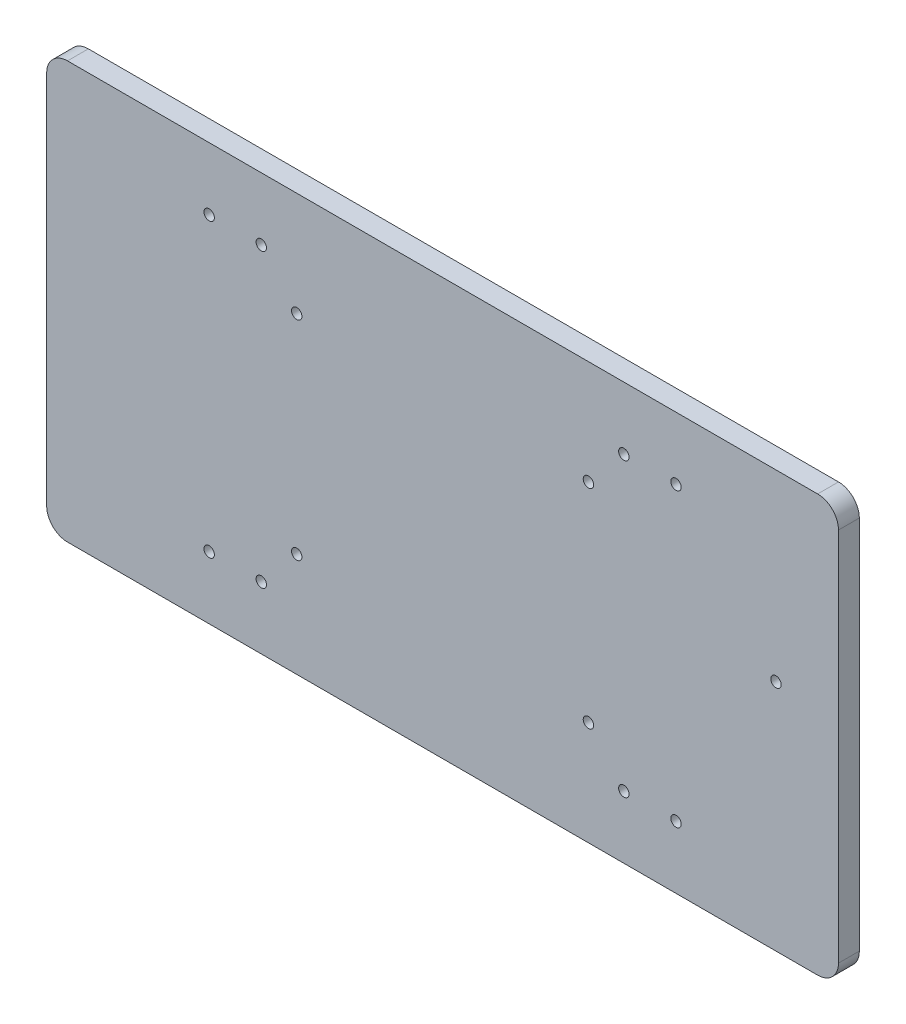
ISO-10303-21;
HEADER;
FILE_DESCRIPTION(('STEP AP214'),'2;1');
FILE_NAME('part.step','',(''),(''),'','','');
FILE_SCHEMA(('AUTOMOTIVE_DESIGN { 1 0 10303 214 1 1 1 1 }'));
ENDSEC;
DATA;
#1=APPLICATION_CONTEXT('core data for automotive mechanical design processes');
#2=APPLICATION_PROTOCOL_DEFINITION('international standard','automotive_design',2000,#1);
#3=PRODUCT_CONTEXT('',#1,'mechanical');
#4=PRODUCT('Part','Part','',(#3));
#5=PRODUCT_RELATED_PRODUCT_CATEGORY('part','',(#4));
#6=PRODUCT_DEFINITION_FORMATION('','',#4);
#7=PRODUCT_DEFINITION_CONTEXT('part definition',#1,'design');
#8=PRODUCT_DEFINITION('design','',#6,#7);
#9=PRODUCT_DEFINITION_SHAPE('','',#8);
#10=(LENGTH_UNIT() NAMED_UNIT(*) SI_UNIT(.MILLI.,.METRE.));
#11=(NAMED_UNIT(*) PLANE_ANGLE_UNIT() SI_UNIT($,.RADIAN.));
#12=(NAMED_UNIT(*) SI_UNIT($,.STERADIAN.) SOLID_ANGLE_UNIT());
#13=UNCERTAINTY_MEASURE_WITH_UNIT(LENGTH_MEASURE(1.E-05),#10,'distance_accuracy_value','');
#14=(GEOMETRIC_REPRESENTATION_CONTEXT(3) GLOBAL_UNCERTAINTY_ASSIGNED_CONTEXT((#13)) GLOBAL_UNIT_ASSIGNED_CONTEXT((#10,
#11,#12)) REPRESENTATION_CONTEXT('',''));
#15=CARTESIAN_POINT('',(0.,0.,0.));
#16=DIRECTION('',(0.,0.,1.));
#17=DIRECTION('',(1.,0.,0.));
#18=AXIS2_PLACEMENT_3D('',#15,#16,#17);
#19=CARTESIAN_POINT('',(0.,50.,5.));
#20=DIRECTION('',(0.,1.,0.));
#21=DIRECTION('',(-1.,0.,0.));
#22=AXIS2_PLACEMENT_3D('',#19,#20,#21);
#23=PLANE('',#22);
#24=DIRECTION('',(1.,0.,0.));
#25=VECTOR('',#24,1.);
#26=CARTESIAN_POINT('',(0.,50.,5.));
#27=LINE('',#26,#25);
#28=CARTESIAN_POINT('',(-90.,50.,5.));
#29=VERTEX_POINT('',#28);
#30=CARTESIAN_POINT('',(90.,50.,5.));
#31=VERTEX_POINT('',#30);
#32=EDGE_CURVE('E180',#29,#31,#27,.T.);
#33=ORIENTED_EDGE('',*,*,#32,.T.);
#34=DIRECTION('',(0.,0.,-1.));
#35=VECTOR('',#34,1.);
#36=CARTESIAN_POINT('',(90.,50.,5.));
#37=LINE('',#36,#35);
#38=CARTESIAN_POINT('',(90.,50.,0.));
#39=VERTEX_POINT('',#38);
#40=EDGE_CURVE('E11',#31,#39,#37,.T.);
#41=ORIENTED_EDGE('',*,*,#40,.T.);
#42=DIRECTION('',(1.,0.,0.));
#43=VECTOR('',#42,1.);
#44=CARTESIAN_POINT('',(0.,50.,0.));
#45=LINE('',#44,#43);
#46=CARTESIAN_POINT('',(-90.,50.,0.));
#47=VERTEX_POINT('',#46);
#48=EDGE_CURVE('E183',#47,#39,#45,.T.);
#49=ORIENTED_EDGE('',*,*,#48,.F.);
#50=DIRECTION('',(0.,0.,-1.));
#51=VECTOR('',#50,1.);
#52=CARTESIAN_POINT('',(-90.,50.,5.));
#53=LINE('',#52,#51);
#54=EDGE_CURVE('E48',#47,#29,#53,.F.);
#55=ORIENTED_EDGE('',*,*,#54,.T.);
#56=EDGE_LOOP('',(#33,#41,#49,#55));
#57=FACE_BOUND('',#56,.T.);
#58=ADVANCED_FACE('F39',(#57),#23,.T.);
#59=CARTESIAN_POINT('',(-95.,0.,5.));
#60=DIRECTION('',(1.,0.,0.));
#61=DIRECTION('',(0.,1.,0.));
#62=AXIS2_PLACEMENT_3D('',#59,#60,#61);
#63=PLANE('',#62);
#64=DIRECTION('',(0.,-1.,0.));
#65=VECTOR('',#64,1.);
#66=CARTESIAN_POINT('',(-95.,0.,0.));
#67=LINE('',#66,#65);
#68=CARTESIAN_POINT('',(-95.,45.,0.));
#69=VERTEX_POINT('',#68);
#70=CARTESIAN_POINT('',(-95.,-45.,0.));
#71=VERTEX_POINT('',#70);
#72=EDGE_CURVE('E129',#69,#71,#67,.T.);
#73=ORIENTED_EDGE('',*,*,#72,.T.);
#74=DIRECTION('',(0.,0.,-1.));
#75=VECTOR('',#74,1.);
#76=CARTESIAN_POINT('',(-95.,-45.,5.));
#77=LINE('',#76,#75);
#78=CARTESIAN_POINT('',(-95.,-45.,5.));
#79=VERTEX_POINT('',#78);
#80=EDGE_CURVE('E156',#71,#79,#77,.F.);
#81=ORIENTED_EDGE('',*,*,#80,.T.);
#82=DIRECTION('',(0.,-1.,0.));
#83=VECTOR('',#82,1.);
#84=CARTESIAN_POINT('',(-95.,0.,5.));
#85=LINE('',#84,#83);
#86=CARTESIAN_POINT('',(-95.,45.,5.));
#87=VERTEX_POINT('',#86);
#88=EDGE_CURVE('E192',#87,#79,#85,.T.);
#89=ORIENTED_EDGE('',*,*,#88,.F.);
#90=DIRECTION('',(0.,0.,-1.));
#91=VECTOR('',#90,1.);
#92=CARTESIAN_POINT('',(-95.,45.,0.));
#93=LINE('',#92,#91);
#94=EDGE_CURVE('E152',#87,#69,#93,.T.);
#95=ORIENTED_EDGE('',*,*,#94,.T.);
#96=EDGE_LOOP('',(#73,#81,#89,#95));
#97=FACE_BOUND('',#96,.T.);
#98=ADVANCED_FACE('F199',(#97),#63,.F.);
#99=CARTESIAN_POINT('',(0.,-50.,5.));
#100=DIRECTION('',(0.,-1.,0.));
#101=DIRECTION('',(1.,0.,0.));
#102=AXIS2_PLACEMENT_3D('',#99,#100,#101);
#103=PLANE('',#102);
#104=DIRECTION('',(-1.,0.,0.));
#105=VECTOR('',#104,1.);
#106=CARTESIAN_POINT('',(0.,-50.,5.));
#107=LINE('',#106,#105);
#108=CARTESIAN_POINT('',(90.,-50.,5.));
#109=VERTEX_POINT('',#108);
#110=CARTESIAN_POINT('',(-90.,-50.,5.));
#111=VERTEX_POINT('',#110);
#112=EDGE_CURVE('E266',#109,#111,#107,.T.);
#113=ORIENTED_EDGE('',*,*,#112,.T.);
#114=DIRECTION('',(0.,0.,-1.));
#115=VECTOR('',#114,1.);
#116=CARTESIAN_POINT('',(-90.,-50.,0.));
#117=LINE('',#116,#115);
#118=CARTESIAN_POINT('',(-90.,-50.,0.));
#119=VERTEX_POINT('',#118);
#120=EDGE_CURVE('E127',#111,#119,#117,.T.);
#121=ORIENTED_EDGE('',*,*,#120,.T.);
#122=DIRECTION('',(-1.,0.,0.));
#123=VECTOR('',#122,1.);
#124=CARTESIAN_POINT('',(0.,-50.,0.));
#125=LINE('',#124,#123);
#126=CARTESIAN_POINT('',(90.,-50.,0.));
#127=VERTEX_POINT('',#126);
#128=EDGE_CURVE('E111',#127,#119,#125,.T.);
#129=ORIENTED_EDGE('',*,*,#128,.F.);
#130=DIRECTION('',(0.,0.,-1.));
#131=VECTOR('',#130,1.);
#132=CARTESIAN_POINT('',(90.,-50.,5.));
#133=LINE('',#132,#131);
#134=EDGE_CURVE('E125',#127,#109,#133,.F.);
#135=ORIENTED_EDGE('',*,*,#134,.T.);
#136=EDGE_LOOP('',(#113,#121,#129,#135));
#137=FACE_BOUND('',#136,.T.);
#138=ADVANCED_FACE('F124',(#137),#103,.T.);
#139=CARTESIAN_POINT('',(-43.5,35.,5.));
#140=DIRECTION('',(0.,0.,-1.));
#141=DIRECTION('',(-1.,0.,0.));
#142=AXIS2_PLACEMENT_3D('',#139,#140,#141);
#143=CYLINDRICAL_SURFACE('',#142,1.25);
#144=CARTESIAN_POINT('',(-43.5,35.,5.));
#145=DIRECTION('',(0.,0.,1.));
#146=DIRECTION('',(1.,0.,0.));
#147=AXIS2_PLACEMENT_3D('',#144,#145,#146);
#148=CIRCLE('',#147,1.25);
#149=CARTESIAN_POINT('',(-42.25,35.,5.));
#150=VERTEX_POINT('',#149);
#151=EDGE_CURVE('E140',#150,#150,#148,.F.);
#152=ORIENTED_EDGE('',*,*,#151,.F.);
#153=EDGE_LOOP('',(#152));
#154=FACE_BOUND('',#153,.T.);
#155=CARTESIAN_POINT('',(-43.5,35.,0.));
#156=DIRECTION('',(0.,0.,1.));
#157=DIRECTION('',(1.,0.,0.));
#158=AXIS2_PLACEMENT_3D('',#155,#156,#157);
#159=CIRCLE('',#158,1.25);
#160=CARTESIAN_POINT('',(-42.25,35.,0.));
#161=VERTEX_POINT('',#160);
#162=EDGE_CURVE('E209',#161,#161,#159,.F.);
#163=ORIENTED_EDGE('',*,*,#162,.T.);
#164=EDGE_LOOP('',(#163));
#165=FACE_BOUND('',#164,.T.);
#166=ADVANCED_FACE('F332',(#154,#165),#143,.F.);
#167=CARTESIAN_POINT('',(95.,0.,5.));
#168=DIRECTION('',(1.,0.,0.));
#169=DIRECTION('',(0.,1.,0.));
#170=AXIS2_PLACEMENT_3D('',#167,#168,#169);
#171=PLANE('',#170);
#172=DIRECTION('',(0.,-1.,0.));
#173=VECTOR('',#172,1.);
#174=CARTESIAN_POINT('',(95.,0.,5.));
#175=LINE('',#174,#173);
#176=CARTESIAN_POINT('',(95.,45.,5.));
#177=VERTEX_POINT('',#176);
#178=CARTESIAN_POINT('',(95.,-45.,5.));
#179=VERTEX_POINT('',#178);
#180=EDGE_CURVE('E269',#177,#179,#175,.T.);
#181=ORIENTED_EDGE('',*,*,#180,.T.);
#182=DIRECTION('',(0.,0.,-1.));
#183=VECTOR('',#182,1.);
#184=CARTESIAN_POINT('',(95.,-45.,5.));
#185=LINE('',#184,#183);
#186=CARTESIAN_POINT('',(95.,-45.,0.));
#187=VERTEX_POINT('',#186);
#188=EDGE_CURVE('E172',#179,#187,#185,.T.);
#189=ORIENTED_EDGE('',*,*,#188,.T.);
#190=DIRECTION('',(0.,-1.,0.));
#191=VECTOR('',#190,1.);
#192=CARTESIAN_POINT('',(95.,0.,0.));
#193=LINE('',#192,#191);
#194=CARTESIAN_POINT('',(95.,45.,0.));
#195=VERTEX_POINT('',#194);
#196=EDGE_CURVE('E112',#195,#187,#193,.T.);
#197=ORIENTED_EDGE('',*,*,#196,.F.);
#198=DIRECTION('',(0.,0.,-1.));
#199=VECTOR('',#198,1.);
#200=CARTESIAN_POINT('',(95.,45.,5.));
#201=LINE('',#200,#199);
#202=EDGE_CURVE('E62',#195,#177,#201,.F.);
#203=ORIENTED_EDGE('',*,*,#202,.T.);
#204=EDGE_LOOP('',(#181,#189,#197,#203));
#205=FACE_BOUND('',#204,.T.);
#206=ADVANCED_FACE('F322',(#205),#171,.T.);
#207=CARTESIAN_POINT('',(35.,25.,5.));
#208=DIRECTION('',(0.,0.,-1.));
#209=DIRECTION('',(-1.,0.,0.));
#210=AXIS2_PLACEMENT_3D('',#207,#208,#209);
#211=CYLINDRICAL_SURFACE('',#210,1.25);
#212=CARTESIAN_POINT('',(35.,25.,5.));
#213=DIRECTION('',(0.,0.,1.));
#214=DIRECTION('',(1.,0.,0.));
#215=AXIS2_PLACEMENT_3D('',#212,#213,#214);
#216=CIRCLE('',#215,1.25);
#217=CARTESIAN_POINT('',(36.25,25.,5.));
#218=VERTEX_POINT('',#217);
#219=EDGE_CURVE('E193',#218,#218,#216,.T.);
#220=ORIENTED_EDGE('',*,*,#219,.T.);
#221=EDGE_LOOP('',(#220));
#222=FACE_BOUND('',#221,.T.);
#223=CARTESIAN_POINT('',(35.,25.,0.));
#224=DIRECTION('',(0.,0.,1.));
#225=DIRECTION('',(1.,0.,0.));
#226=AXIS2_PLACEMENT_3D('',#223,#224,#225);
#227=CIRCLE('',#226,1.25);
#228=CARTESIAN_POINT('',(36.25,25.,0.));
#229=VERTEX_POINT('',#228);
#230=EDGE_CURVE('E204',#229,#229,#227,.T.);
#231=ORIENTED_EDGE('',*,*,#230,.F.);
#232=EDGE_LOOP('',(#231));
#233=FACE_BOUND('',#232,.T.);
#234=ADVANCED_FACE('F319',(#222,#233),#211,.F.);
#235=CARTESIAN_POINT('',(80.,5.96994535519127,5.));
#236=DIRECTION('',(0.,0.,-1.));
#237=DIRECTION('',(-1.,0.,0.));
#238=AXIS2_PLACEMENT_3D('',#235,#236,#237);
#239=CYLINDRICAL_SURFACE('',#238,1.25);
#240=CARTESIAN_POINT('',(80.,5.96994535519127,5.));
#241=DIRECTION('',(0.,0.,1.));
#242=DIRECTION('',(1.,0.,0.));
#243=AXIS2_PLACEMENT_3D('',#240,#241,#242);
#244=CIRCLE('',#243,1.25);
#245=CARTESIAN_POINT('',(81.25,5.96994535519127,5.));
#246=VERTEX_POINT('',#245);
#247=EDGE_CURVE('E257',#246,#246,#244,.T.);
#248=ORIENTED_EDGE('',*,*,#247,.T.);
#249=EDGE_LOOP('',(#248));
#250=FACE_BOUND('',#249,.T.);
#251=CARTESIAN_POINT('',(80.,5.96994535519127,0.));
#252=DIRECTION('',(0.,0.,1.));
#253=DIRECTION('',(1.,0.,0.));
#254=AXIS2_PLACEMENT_3D('',#251,#252,#253);
#255=CIRCLE('',#254,1.25);
#256=CARTESIAN_POINT('',(81.25,5.96994535519127,0.));
#257=VERTEX_POINT('',#256);
#258=EDGE_CURVE('E311',#257,#257,#255,.T.);
#259=ORIENTED_EDGE('',*,*,#258,.F.);
#260=EDGE_LOOP('',(#259));
#261=FACE_BOUND('',#260,.T.);
#262=ADVANCED_FACE('F321',(#250,#261),#239,.F.);
#263=CARTESIAN_POINT('',(-43.5,-35.,5.));
#264=DIRECTION('',(0.,0.,-1.));
#265=DIRECTION('',(-1.,0.,0.));
#266=AXIS2_PLACEMENT_3D('',#263,#264,#265);
#267=CYLINDRICAL_SURFACE('',#266,1.25);
#268=CARTESIAN_POINT('',(-43.5,-35.,5.));
#269=DIRECTION('',(0.,0.,1.));
#270=DIRECTION('',(1.,0.,0.));
#271=AXIS2_PLACEMENT_3D('',#268,#269,#270);
#272=CIRCLE('',#271,1.25);
#273=CARTESIAN_POINT('',(-42.25,-35.,5.));
#274=VERTEX_POINT('',#273);
#275=EDGE_CURVE('E253',#274,#274,#272,.T.);
#276=ORIENTED_EDGE('',*,*,#275,.T.);
#277=EDGE_LOOP('',(#276));
#278=FACE_BOUND('',#277,.T.);
#279=CARTESIAN_POINT('',(-43.5,-35.,0.));
#280=DIRECTION('',(0.,0.,1.));
#281=DIRECTION('',(1.,0.,0.));
#282=AXIS2_PLACEMENT_3D('',#279,#280,#281);
#283=CIRCLE('',#282,1.25);
#284=CARTESIAN_POINT('',(-42.25,-35.,0.));
#285=VERTEX_POINT('',#284);
#286=EDGE_CURVE('E307',#285,#285,#283,.T.);
#287=ORIENTED_EDGE('',*,*,#286,.F.);
#288=EDGE_LOOP('',(#287));
#289=FACE_BOUND('',#288,.T.);
#290=ADVANCED_FACE('F329',(#278,#289),#267,.F.);
#291=CARTESIAN_POINT('',(-56.0092746529231,-35.,5.));
#292=DIRECTION('',(0.,0.,-1.));
#293=DIRECTION('',(-1.,0.,0.));
#294=AXIS2_PLACEMENT_3D('',#291,#292,#293);
#295=CYLINDRICAL_SURFACE('',#294,1.25);
#296=CARTESIAN_POINT('',(-56.0092746529231,-35.,5.));
#297=DIRECTION('',(0.,0.,1.));
#298=DIRECTION('',(1.,0.,0.));
#299=AXIS2_PLACEMENT_3D('',#296,#297,#298);
#300=CIRCLE('',#299,1.25);
#301=CARTESIAN_POINT('',(-54.7592746529231,-35.,5.));
#302=VERTEX_POINT('',#301);
#303=EDGE_CURVE('E249',#302,#302,#300,.T.);
#304=ORIENTED_EDGE('',*,*,#303,.T.);
#305=EDGE_LOOP('',(#304));
#306=FACE_BOUND('',#305,.T.);
#307=CARTESIAN_POINT('',(-56.0092746529231,-35.,0.));
#308=DIRECTION('',(0.,0.,1.));
#309=DIRECTION('',(1.,0.,0.));
#310=AXIS2_PLACEMENT_3D('',#307,#308,#309);
#311=CIRCLE('',#310,1.25);
#312=CARTESIAN_POINT('',(-54.7592746529231,-35.,0.));
#313=VERTEX_POINT('',#312);
#314=EDGE_CURVE('E303',#313,#313,#311,.T.);
#315=ORIENTED_EDGE('',*,*,#314,.F.);
#316=EDGE_LOOP('',(#315));
#317=FACE_BOUND('',#316,.T.);
#318=ADVANCED_FACE('F385',(#306,#317),#295,.F.);
#319=CARTESIAN_POINT('',(-56.0092746529231,35.,5.));
#320=DIRECTION('',(0.,0.,-1.));
#321=DIRECTION('',(-1.,0.,0.));
#322=AXIS2_PLACEMENT_3D('',#319,#320,#321);
#323=CYLINDRICAL_SURFACE('',#322,1.25);
#324=CARTESIAN_POINT('',(-56.0092746529231,35.,5.));
#325=DIRECTION('',(0.,0.,1.));
#326=DIRECTION('',(1.,0.,0.));
#327=AXIS2_PLACEMENT_3D('',#324,#325,#326);
#328=CIRCLE('',#327,1.25);
#329=CARTESIAN_POINT('',(-54.7592746529231,35.,5.));
#330=VERTEX_POINT('',#329);
#331=EDGE_CURVE('E245',#330,#330,#328,.F.);
#332=ORIENTED_EDGE('',*,*,#331,.F.);
#333=EDGE_LOOP('',(#332));
#334=FACE_BOUND('',#333,.T.);
#335=CARTESIAN_POINT('',(-56.0092746529231,35.,0.));
#336=DIRECTION('',(0.,0.,1.));
#337=DIRECTION('',(1.,0.,0.));
#338=AXIS2_PLACEMENT_3D('',#335,#336,#337);
#339=CIRCLE('',#338,1.25);
#340=CARTESIAN_POINT('',(-54.7592746529231,35.,0.));
#341=VERTEX_POINT('',#340);
#342=EDGE_CURVE('E299',#341,#341,#339,.F.);
#343=ORIENTED_EDGE('',*,*,#342,.T.);
#344=EDGE_LOOP('',(#343));
#345=FACE_BOUND('',#344,.T.);
#346=ADVANCED_FACE('F392',(#334,#345),#323,.F.);
#347=CARTESIAN_POINT('',(43.5,-35.,5.));
#348=DIRECTION('',(0.,0.,-1.));
#349=DIRECTION('',(-1.,0.,0.));
#350=AXIS2_PLACEMENT_3D('',#347,#348,#349);
#351=CYLINDRICAL_SURFACE('',#350,1.25);
#352=CARTESIAN_POINT('',(43.5,-35.,5.));
#353=DIRECTION('',(0.,0.,1.));
#354=DIRECTION('',(1.,0.,0.));
#355=AXIS2_PLACEMENT_3D('',#352,#353,#354);
#356=CIRCLE('',#355,1.25);
#357=CARTESIAN_POINT('',(44.75,-35.,5.));
#358=VERTEX_POINT('',#357);
#359=EDGE_CURVE('E241',#358,#358,#356,.F.);
#360=ORIENTED_EDGE('',*,*,#359,.F.);
#361=EDGE_LOOP('',(#360));
#362=FACE_BOUND('',#361,.T.);
#363=CARTESIAN_POINT('',(43.5,-35.,0.));
#364=DIRECTION('',(0.,0.,1.));
#365=DIRECTION('',(1.,0.,0.));
#366=AXIS2_PLACEMENT_3D('',#363,#364,#365);
#367=CIRCLE('',#366,1.25);
#368=CARTESIAN_POINT('',(44.75,-35.,0.));
#369=VERTEX_POINT('',#368);
#370=EDGE_CURVE('E295',#369,#369,#367,.F.);
#371=ORIENTED_EDGE('',*,*,#370,.T.);
#372=EDGE_LOOP('',(#371));
#373=FACE_BOUND('',#372,.T.);
#374=ADVANCED_FACE('F398',(#362,#373),#351,.F.);
#375=CARTESIAN_POINT('',(43.5,35.,5.));
#376=DIRECTION('',(0.,0.,-1.));
#377=DIRECTION('',(-1.,0.,0.));
#378=AXIS2_PLACEMENT_3D('',#375,#376,#377);
#379=CYLINDRICAL_SURFACE('',#378,1.25);
#380=CARTESIAN_POINT('',(43.5,35.,5.));
#381=DIRECTION('',(0.,0.,1.));
#382=DIRECTION('',(1.,0.,0.));
#383=AXIS2_PLACEMENT_3D('',#380,#381,#382);
#384=CIRCLE('',#383,1.25);
#385=CARTESIAN_POINT('',(44.75,35.,5.));
#386=VERTEX_POINT('',#385);
#387=EDGE_CURVE('E237',#386,#386,#384,.T.);
#388=ORIENTED_EDGE('',*,*,#387,.T.);
#389=EDGE_LOOP('',(#388));
#390=FACE_BOUND('',#389,.T.);
#391=CARTESIAN_POINT('',(43.5,35.,0.));
#392=DIRECTION('',(0.,0.,1.));
#393=DIRECTION('',(1.,0.,0.));
#394=AXIS2_PLACEMENT_3D('',#391,#392,#393);
#395=CIRCLE('',#394,1.25);
#396=CARTESIAN_POINT('',(44.75,35.,0.));
#397=VERTEX_POINT('',#396);
#398=EDGE_CURVE('E291',#397,#397,#395,.T.);
#399=ORIENTED_EDGE('',*,*,#398,.F.);
#400=EDGE_LOOP('',(#399));
#401=FACE_BOUND('',#400,.T.);
#402=ADVANCED_FACE('F402',(#390,#401),#379,.F.);
#403=CARTESIAN_POINT('',(56.0092746529231,35.,5.));
#404=DIRECTION('',(0.,0.,-1.));
#405=DIRECTION('',(-1.,0.,0.));
#406=AXIS2_PLACEMENT_3D('',#403,#404,#405);
#407=CYLINDRICAL_SURFACE('',#406,1.25);
#408=CARTESIAN_POINT('',(56.0092746529231,35.,5.));
#409=DIRECTION('',(0.,0.,1.));
#410=DIRECTION('',(1.,0.,0.));
#411=AXIS2_PLACEMENT_3D('',#408,#409,#410);
#412=CIRCLE('',#411,1.25);
#413=CARTESIAN_POINT('',(57.2592746529231,35.,5.));
#414=VERTEX_POINT('',#413);
#415=EDGE_CURVE('E233',#414,#414,#412,.T.);
#416=ORIENTED_EDGE('',*,*,#415,.T.);
#417=EDGE_LOOP('',(#416));
#418=FACE_BOUND('',#417,.T.);
#419=CARTESIAN_POINT('',(56.0092746529231,35.,0.));
#420=DIRECTION('',(0.,0.,1.));
#421=DIRECTION('',(1.,0.,0.));
#422=AXIS2_PLACEMENT_3D('',#419,#420,#421);
#423=CIRCLE('',#422,1.25);
#424=CARTESIAN_POINT('',(57.2592746529231,35.,0.));
#425=VERTEX_POINT('',#424);
#426=EDGE_CURVE('E287',#425,#425,#423,.T.);
#427=ORIENTED_EDGE('',*,*,#426,.F.);
#428=EDGE_LOOP('',(#427));
#429=FACE_BOUND('',#428,.T.);
#430=ADVANCED_FACE('F406',(#418,#429),#407,.F.);
#431=CARTESIAN_POINT('',(-35.,25.,5.));
#432=DIRECTION('',(0.,0.,-1.));
#433=DIRECTION('',(-1.,0.,0.));
#434=AXIS2_PLACEMENT_3D('',#431,#432,#433);
#435=CYLINDRICAL_SURFACE('',#434,1.25);
#436=CARTESIAN_POINT('',(-35.,25.,5.));
#437=DIRECTION('',(0.,0.,1.));
#438=DIRECTION('',(1.,0.,0.));
#439=AXIS2_PLACEMENT_3D('',#436,#437,#438);
#440=CIRCLE('',#439,1.25);
#441=CARTESIAN_POINT('',(-33.75,25.,5.));
#442=VERTEX_POINT('',#441);
#443=EDGE_CURVE('E227',#442,#442,#440,.T.);
#444=ORIENTED_EDGE('',*,*,#443,.T.);
#445=EDGE_LOOP('',(#444));
#446=FACE_BOUND('',#445,.T.);
#447=CARTESIAN_POINT('',(-35.,25.,0.));
#448=DIRECTION('',(0.,0.,1.));
#449=DIRECTION('',(1.,0.,0.));
#450=AXIS2_PLACEMENT_3D('',#447,#448,#449);
#451=CIRCLE('',#450,1.25);
#452=CARTESIAN_POINT('',(-33.75,25.,0.));
#453=VERTEX_POINT('',#452);
#454=EDGE_CURVE('E283',#453,#453,#451,.T.);
#455=ORIENTED_EDGE('',*,*,#454,.F.);
#456=EDGE_LOOP('',(#455));
#457=FACE_BOUND('',#456,.T.);
#458=ADVANCED_FACE('F410',(#446,#457),#435,.F.);
#459=CARTESIAN_POINT('',(-35.,-25.,5.));
#460=DIRECTION('',(0.,0.,-1.));
#461=DIRECTION('',(-1.,0.,0.));
#462=AXIS2_PLACEMENT_3D('',#459,#460,#461);
#463=CYLINDRICAL_SURFACE('',#462,1.25);
#464=CARTESIAN_POINT('',(-35.,-25.,5.));
#465=DIRECTION('',(0.,0.,1.));
#466=DIRECTION('',(1.,0.,0.));
#467=AXIS2_PLACEMENT_3D('',#464,#465,#466);
#468=CIRCLE('',#467,1.25);
#469=CARTESIAN_POINT('',(-33.75,-25.,5.));
#470=VERTEX_POINT('',#469);
#471=EDGE_CURVE('E221',#470,#470,#468,.T.);
#472=ORIENTED_EDGE('',*,*,#471,.T.);
#473=EDGE_LOOP('',(#472));
#474=FACE_BOUND('',#473,.T.);
#475=CARTESIAN_POINT('',(-35.,-25.,0.));
#476=DIRECTION('',(0.,0.,1.));
#477=DIRECTION('',(1.,0.,0.));
#478=AXIS2_PLACEMENT_3D('',#475,#476,#477);
#479=CIRCLE('',#478,1.25);
#480=CARTESIAN_POINT('',(-33.75,-25.,0.));
#481=VERTEX_POINT('',#480);
#482=EDGE_CURVE('E279',#481,#481,#479,.T.);
#483=ORIENTED_EDGE('',*,*,#482,.F.);
#484=EDGE_LOOP('',(#483));
#485=FACE_BOUND('',#484,.T.);
#486=ADVANCED_FACE('F414',(#474,#485),#463,.F.);
#487=CARTESIAN_POINT('',(35.,-25.,5.));
#488=DIRECTION('',(0.,0.,-1.));
#489=DIRECTION('',(-1.,0.,0.));
#490=AXIS2_PLACEMENT_3D('',#487,#488,#489);
#491=CYLINDRICAL_SURFACE('',#490,1.25);
#492=CARTESIAN_POINT('',(35.,-25.,5.));
#493=DIRECTION('',(0.,0.,1.));
#494=DIRECTION('',(1.,0.,0.));
#495=AXIS2_PLACEMENT_3D('',#492,#493,#494);
#496=CIRCLE('',#495,1.25);
#497=CARTESIAN_POINT('',(36.25,-25.,5.));
#498=VERTEX_POINT('',#497);
#499=EDGE_CURVE('E216',#498,#498,#496,.T.);
#500=ORIENTED_EDGE('',*,*,#499,.T.);
#501=EDGE_LOOP('',(#500));
#502=FACE_BOUND('',#501,.T.);
#503=CARTESIAN_POINT('',(35.,-25.,0.));
#504=DIRECTION('',(0.,0.,1.));
#505=DIRECTION('',(1.,0.,0.));
#506=AXIS2_PLACEMENT_3D('',#503,#504,#505);
#507=CIRCLE('',#506,1.25);
#508=CARTESIAN_POINT('',(36.25,-25.,0.));
#509=VERTEX_POINT('',#508);
#510=EDGE_CURVE('E275',#509,#509,#507,.T.);
#511=ORIENTED_EDGE('',*,*,#510,.F.);
#512=EDGE_LOOP('',(#511));
#513=FACE_BOUND('',#512,.T.);
#514=ADVANCED_FACE('F349',(#502,#513),#491,.F.);
#515=CARTESIAN_POINT('',(56.0092746529231,-35.,5.));
#516=DIRECTION('',(0.,0.,-1.));
#517=DIRECTION('',(-1.,0.,0.));
#518=AXIS2_PLACEMENT_3D('',#515,#516,#517);
#519=CYLINDRICAL_SURFACE('',#518,1.25);
#520=CARTESIAN_POINT('',(56.0092746529231,-35.,5.));
#521=DIRECTION('',(0.,0.,1.));
#522=DIRECTION('',(1.,0.,0.));
#523=AXIS2_PLACEMENT_3D('',#520,#521,#522);
#524=CIRCLE('',#523,1.25);
#525=CARTESIAN_POINT('',(57.2592746529231,-35.,5.));
#526=VERTEX_POINT('',#525);
#527=EDGE_CURVE('E133',#526,#526,#524,.F.);
#528=ORIENTED_EDGE('',*,*,#527,.F.);
#529=EDGE_LOOP('',(#528));
#530=FACE_BOUND('',#529,.T.);
#531=CARTESIAN_POINT('',(56.0092746529231,-35.,0.));
#532=DIRECTION('',(0.,0.,1.));
#533=DIRECTION('',(1.,0.,0.));
#534=AXIS2_PLACEMENT_3D('',#531,#532,#533);
#535=CIRCLE('',#534,1.25);
#536=CARTESIAN_POINT('',(57.2592746529231,-35.,0.));
#537=VERTEX_POINT('',#536);
#538=EDGE_CURVE('E143',#537,#537,#535,.F.);
#539=ORIENTED_EDGE('',*,*,#538,.T.);
#540=EDGE_LOOP('',(#539));
#541=FACE_BOUND('',#540,.T.);
#542=ADVANCED_FACE('F346',(#530,#541),#519,.F.);
#543=CARTESIAN_POINT('',(0.,0.,5.));
#544=DIRECTION('',(0.,0.,1.));
#545=DIRECTION('',(1.,0.,0.));
#546=AXIS2_PLACEMENT_3D('',#543,#544,#545);
#547=PLANE('',#546);
#548=ORIENTED_EDGE('',*,*,#499,.F.);
#549=EDGE_LOOP('',(#548));
#550=FACE_BOUND('',#549,.T.);
#551=ORIENTED_EDGE('',*,*,#471,.F.);
#552=EDGE_LOOP('',(#551));
#553=FACE_BOUND('',#552,.T.);
#554=ORIENTED_EDGE('',*,*,#443,.F.);
#555=EDGE_LOOP('',(#554));
#556=FACE_BOUND('',#555,.T.);
#557=ORIENTED_EDGE('',*,*,#415,.F.);
#558=EDGE_LOOP('',(#557));
#559=FACE_BOUND('',#558,.T.);
#560=ORIENTED_EDGE('',*,*,#387,.F.);
#561=EDGE_LOOP('',(#560));
#562=FACE_BOUND('',#561,.T.);
#563=ORIENTED_EDGE('',*,*,#359,.T.);
#564=EDGE_LOOP('',(#563));
#565=FACE_BOUND('',#564,.T.);
#566=ORIENTED_EDGE('',*,*,#331,.T.);
#567=EDGE_LOOP('',(#566));
#568=FACE_BOUND('',#567,.T.);
#569=ORIENTED_EDGE('',*,*,#303,.F.);
#570=EDGE_LOOP('',(#569));
#571=FACE_BOUND('',#570,.T.);
#572=ORIENTED_EDGE('',*,*,#275,.F.);
#573=EDGE_LOOP('',(#572));
#574=FACE_BOUND('',#573,.T.);
#575=ORIENTED_EDGE('',*,*,#247,.F.);
#576=EDGE_LOOP('',(#575));
#577=FACE_BOUND('',#576,.T.);
#578=ORIENTED_EDGE('',*,*,#219,.F.);
#579=EDGE_LOOP('',(#578));
#580=FACE_BOUND('',#579,.T.);
#581=ORIENTED_EDGE('',*,*,#88,.T.);
#582=CARTESIAN_POINT('',(-90.,-45.,5.));
#583=DIRECTION('',(0.,0.,1.));
#584=DIRECTION('',(1.,0.,0.));
#585=AXIS2_PLACEMENT_3D('',#582,#583,#584);
#586=CIRCLE('',#585,5.);
#587=EDGE_CURVE('E167',#79,#111,#586,.T.);
#588=ORIENTED_EDGE('',*,*,#587,.T.);
#589=ORIENTED_EDGE('',*,*,#112,.F.);
#590=CARTESIAN_POINT('',(90.,-45.,5.));
#591=DIRECTION('',(0.,0.,1.));
#592=DIRECTION('',(1.,0.,0.));
#593=AXIS2_PLACEMENT_3D('',#590,#591,#592);
#594=CIRCLE('',#593,5.);
#595=EDGE_CURVE('E55',#109,#179,#594,.T.);
#596=ORIENTED_EDGE('',*,*,#595,.T.);
#597=ORIENTED_EDGE('',*,*,#180,.F.);
#598=CARTESIAN_POINT('',(90.,45.,5.));
#599=DIRECTION('',(0.,0.,1.));
#600=DIRECTION('',(1.,0.,0.));
#601=AXIS2_PLACEMENT_3D('',#598,#599,#600);
#602=CIRCLE('',#601,5.);
#603=EDGE_CURVE('E162',#177,#31,#602,.T.);
#604=ORIENTED_EDGE('',*,*,#603,.T.);
#605=ORIENTED_EDGE('',*,*,#32,.F.);
#606=CARTESIAN_POINT('',(-90.,45.,5.));
#607=DIRECTION('',(0.,0.,1.));
#608=DIRECTION('',(1.,0.,0.));
#609=AXIS2_PLACEMENT_3D('',#606,#607,#608);
#610=CIRCLE('',#609,5.);
#611=EDGE_CURVE('E159',#29,#87,#610,.T.);
#612=ORIENTED_EDGE('',*,*,#611,.T.);
#613=EDGE_LOOP('',(#581,#588,#589,#596,#597,#604,#605,#612));
#614=FACE_BOUND('',#613,.T.);
#615=ORIENTED_EDGE('',*,*,#151,.T.);
#616=EDGE_LOOP('',(#615));
#617=FACE_BOUND('',#616,.T.);
#618=ORIENTED_EDGE('',*,*,#527,.T.);
#619=EDGE_LOOP('',(#618));
#620=FACE_BOUND('',#619,.T.);
#621=ADVANCED_FACE('F187',(#550,#553,#556,#559,#562,#565,#568,#571,#574,#577,#580,#614,#617,
#620),#547,.T.);
#622=CARTESIAN_POINT('',(0.,0.,0.));
#623=DIRECTION('',(0.,0.,1.));
#624=DIRECTION('',(1.,0.,0.));
#625=AXIS2_PLACEMENT_3D('',#622,#623,#624);
#626=PLANE('',#625);
#627=ORIENTED_EDGE('',*,*,#510,.T.);
#628=EDGE_LOOP('',(#627));
#629=FACE_BOUND('',#628,.T.);
#630=ORIENTED_EDGE('',*,*,#482,.T.);
#631=EDGE_LOOP('',(#630));
#632=FACE_BOUND('',#631,.T.);
#633=ORIENTED_EDGE('',*,*,#454,.T.);
#634=EDGE_LOOP('',(#633));
#635=FACE_BOUND('',#634,.T.);
#636=ORIENTED_EDGE('',*,*,#426,.T.);
#637=EDGE_LOOP('',(#636));
#638=FACE_BOUND('',#637,.T.);
#639=ORIENTED_EDGE('',*,*,#398,.T.);
#640=EDGE_LOOP('',(#639));
#641=FACE_BOUND('',#640,.T.);
#642=ORIENTED_EDGE('',*,*,#370,.F.);
#643=EDGE_LOOP('',(#642));
#644=FACE_BOUND('',#643,.T.);
#645=ORIENTED_EDGE('',*,*,#342,.F.);
#646=EDGE_LOOP('',(#645));
#647=FACE_BOUND('',#646,.T.);
#648=ORIENTED_EDGE('',*,*,#314,.T.);
#649=EDGE_LOOP('',(#648));
#650=FACE_BOUND('',#649,.T.);
#651=ORIENTED_EDGE('',*,*,#286,.T.);
#652=EDGE_LOOP('',(#651));
#653=FACE_BOUND('',#652,.T.);
#654=ORIENTED_EDGE('',*,*,#258,.T.);
#655=EDGE_LOOP('',(#654));
#656=FACE_BOUND('',#655,.T.);
#657=ORIENTED_EDGE('',*,*,#230,.T.);
#658=EDGE_LOOP('',(#657));
#659=FACE_BOUND('',#658,.T.);
#660=ORIENTED_EDGE('',*,*,#128,.T.);
#661=CARTESIAN_POINT('',(-90.,-45.,0.));
#662=DIRECTION('',(0.,0.,1.));
#663=DIRECTION('',(1.,0.,0.));
#664=AXIS2_PLACEMENT_3D('',#661,#662,#663);
#665=CIRCLE('',#664,5.);
#666=EDGE_CURVE('E118',#119,#71,#665,.F.);
#667=ORIENTED_EDGE('',*,*,#666,.T.);
#668=ORIENTED_EDGE('',*,*,#72,.F.);
#669=CARTESIAN_POINT('',(-90.,45.,0.));
#670=DIRECTION('',(0.,0.,1.));
#671=DIRECTION('',(1.,0.,0.));
#672=AXIS2_PLACEMENT_3D('',#669,#670,#671);
#673=CIRCLE('',#672,5.);
#674=EDGE_CURVE('E137',#69,#47,#673,.F.);
#675=ORIENTED_EDGE('',*,*,#674,.T.);
#676=ORIENTED_EDGE('',*,*,#48,.T.);
#677=CARTESIAN_POINT('',(90.,45.,0.));
#678=DIRECTION('',(0.,0.,1.));
#679=DIRECTION('',(1.,0.,0.));
#680=AXIS2_PLACEMENT_3D('',#677,#678,#679);
#681=CIRCLE('',#680,5.);
#682=EDGE_CURVE('E119',#39,#195,#681,.F.);
#683=ORIENTED_EDGE('',*,*,#682,.T.);
#684=ORIENTED_EDGE('',*,*,#196,.T.);
#685=CARTESIAN_POINT('',(90.,-45.,0.));
#686=DIRECTION('',(0.,0.,1.));
#687=DIRECTION('',(1.,0.,0.));
#688=AXIS2_PLACEMENT_3D('',#685,#686,#687);
#689=CIRCLE('',#688,5.);
#690=EDGE_CURVE('E107',#187,#127,#689,.F.);
#691=ORIENTED_EDGE('',*,*,#690,.T.);
#692=EDGE_LOOP('',(#660,#667,#668,#675,#676,#683,#684,#691));
#693=FACE_BOUND('',#692,.T.);
#694=ORIENTED_EDGE('',*,*,#162,.F.);
#695=EDGE_LOOP('',(#694));
#696=FACE_BOUND('',#695,.T.);
#697=ORIENTED_EDGE('',*,*,#538,.F.);
#698=EDGE_LOOP('',(#697));
#699=FACE_BOUND('',#698,.T.);
#700=ADVANCED_FACE('F109',(#629,#632,#635,#638,#641,#644,#647,#650,#653,#656,#659,#693,#696,
#699),#626,.F.);
#701=CARTESIAN_POINT('',(-90.,-45.,5.));
#702=DIRECTION('',(0.,0.,1.));
#703=DIRECTION('',(1.,0.,0.));
#704=AXIS2_PLACEMENT_3D('',#701,#702,#703);
#705=CYLINDRICAL_SURFACE('',#704,5.);
#706=ORIENTED_EDGE('',*,*,#587,.F.);
#707=ORIENTED_EDGE('',*,*,#80,.F.);
#708=ORIENTED_EDGE('',*,*,#666,.F.);
#709=ORIENTED_EDGE('',*,*,#120,.F.);
#710=EDGE_LOOP('',(#706,#707,#708,#709));
#711=FACE_BOUND('',#710,.T.);
#712=ADVANCED_FACE('F353',(#711),#705,.T.);
#713=CARTESIAN_POINT('',(90.,-45.,5.));
#714=DIRECTION('',(0.,0.,-1.));
#715=DIRECTION('',(-1.,0.,0.));
#716=AXIS2_PLACEMENT_3D('',#713,#714,#715);
#717=CYLINDRICAL_SURFACE('',#716,5.);
#718=ORIENTED_EDGE('',*,*,#595,.F.);
#719=ORIENTED_EDGE('',*,*,#134,.F.);
#720=ORIENTED_EDGE('',*,*,#690,.F.);
#721=ORIENTED_EDGE('',*,*,#188,.F.);
#722=EDGE_LOOP('',(#718,#719,#720,#721));
#723=FACE_BOUND('',#722,.T.);
#724=ADVANCED_FACE('F131',(#723),#717,.T.);
#725=CARTESIAN_POINT('',(90.,45.,5.));
#726=DIRECTION('',(0.,0.,-1.));
#727=DIRECTION('',(-1.,0.,0.));
#728=AXIS2_PLACEMENT_3D('',#725,#726,#727);
#729=CYLINDRICAL_SURFACE('',#728,5.);
#730=ORIENTED_EDGE('',*,*,#603,.F.);
#731=ORIENTED_EDGE('',*,*,#202,.F.);
#732=ORIENTED_EDGE('',*,*,#682,.F.);
#733=ORIENTED_EDGE('',*,*,#40,.F.);
#734=EDGE_LOOP('',(#730,#731,#732,#733));
#735=FACE_BOUND('',#734,.T.);
#736=ADVANCED_FACE('F425',(#735),#729,.T.);
#737=CARTESIAN_POINT('',(-90.,45.,5.));
#738=DIRECTION('',(0.,0.,1.));
#739=DIRECTION('',(1.,0.,0.));
#740=AXIS2_PLACEMENT_3D('',#737,#738,#739);
#741=CYLINDRICAL_SURFACE('',#740,5.);
#742=ORIENTED_EDGE('',*,*,#611,.F.);
#743=ORIENTED_EDGE('',*,*,#54,.F.);
#744=ORIENTED_EDGE('',*,*,#674,.F.);
#745=ORIENTED_EDGE('',*,*,#94,.F.);
#746=EDGE_LOOP('',(#742,#743,#744,#745));
#747=FACE_BOUND('',#746,.T.);
#748=ADVANCED_FACE('F41',(#747),#741,.T.);
#749=CLOSED_SHELL('',(#58,#98,#138,#166,#206,#234,#262,#290,#318,#346,#374,#402,#430,#458,#486,
#514,#542,#621,#700,#712,#724,#736,#748));
#750=MANIFOLD_SOLID_BREP('B2',#749);
#751=ADVANCED_BREP_SHAPE_REPRESENTATION('',(#18,#750),#14);
#752=SHAPE_DEFINITION_REPRESENTATION(#9,#751);
ENDSEC;
END-ISO-10303-21;
